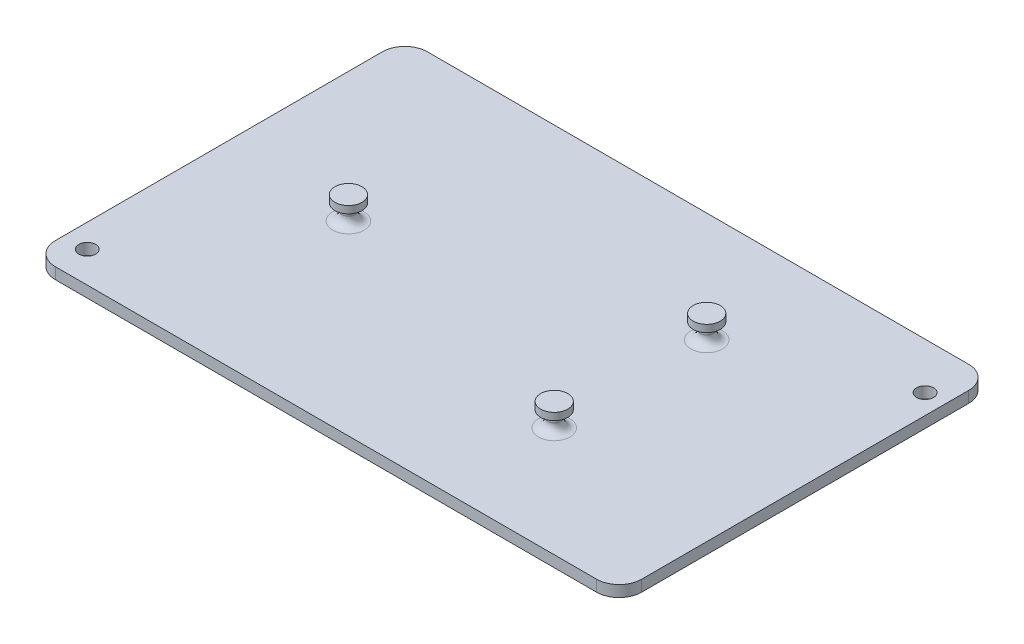
ISO-10303-21;
HEADER;
FILE_DESCRIPTION(('STEP AP214'),'2;1');
FILE_NAME('part.step','',(''),(''),'','','');
FILE_SCHEMA(('AUTOMOTIVE_DESIGN { 1 0 10303 214 1 1 1 1 }'));
ENDSEC;
DATA;
#1=APPLICATION_CONTEXT('core data for automotive mechanical design processes');
#2=APPLICATION_PROTOCOL_DEFINITION('international standard','automotive_design',2000,#1);
#3=PRODUCT_CONTEXT('',#1,'mechanical');
#4=PRODUCT('Part','Part','',(#3));
#5=PRODUCT_RELATED_PRODUCT_CATEGORY('part','',(#4));
#6=PRODUCT_DEFINITION_FORMATION('','',#4);
#7=PRODUCT_DEFINITION_CONTEXT('part definition',#1,'design');
#8=PRODUCT_DEFINITION('design','',#6,#7);
#9=PRODUCT_DEFINITION_SHAPE('','',#8);
#10=(LENGTH_UNIT() NAMED_UNIT(*) SI_UNIT(.MILLI.,.METRE.));
#11=(NAMED_UNIT(*) PLANE_ANGLE_UNIT() SI_UNIT($,.RADIAN.));
#12=(NAMED_UNIT(*) SI_UNIT($,.STERADIAN.) SOLID_ANGLE_UNIT());
#13=UNCERTAINTY_MEASURE_WITH_UNIT(LENGTH_MEASURE(1.E-05),#10,'distance_accuracy_value','');
#14=(GEOMETRIC_REPRESENTATION_CONTEXT(3) GLOBAL_UNCERTAINTY_ASSIGNED_CONTEXT((#13)) GLOBAL_UNIT_ASSIGNED_CONTEXT((#10,
#11,#12)) REPRESENTATION_CONTEXT('',''));
#15=CARTESIAN_POINT('',(0.,0.,0.));
#16=DIRECTION('',(0.,0.,1.));
#17=DIRECTION('',(1.,0.,0.));
#18=AXIS2_PLACEMENT_3D('',#15,#16,#17);
#19=CARTESIAN_POINT('',(82.55,3.175,52.3875));
#20=DIRECTION('',(-1.,0.,0.));
#21=DIRECTION('',(0.,0.,1.));
#22=AXIS2_PLACEMENT_3D('',#19,#20,#21);
#23=PLANE('',#22);
#24=DIRECTION('',(0.,0.,-1.));
#25=VECTOR('',#24,1.);
#26=CARTESIAN_POINT('',(82.55,0.,52.3875));
#27=LINE('',#26,#25);
#28=CARTESIAN_POINT('',(82.55,0.,46.0375));
#29=VERTEX_POINT('',#28);
#30=CARTESIAN_POINT('',(82.55,0.,-46.0375));
#31=VERTEX_POINT('',#30);
#32=EDGE_CURVE('E141',#29,#31,#27,.T.);
#33=ORIENTED_EDGE('',*,*,#32,.T.);
#34=DIRECTION('',(0.,-1.,0.));
#35=VECTOR('',#34,1.);
#36=CARTESIAN_POINT('',(82.55,3.175,-46.0375));
#37=LINE('',#36,#35);
#38=CARTESIAN_POINT('',(82.55,3.175,-46.0375));
#39=VERTEX_POINT('',#38);
#40=EDGE_CURVE('E11',#31,#39,#37,.F.);
#41=ORIENTED_EDGE('',*,*,#40,.T.);
#42=DIRECTION('',(0.,0.,-1.));
#43=VECTOR('',#42,1.);
#44=CARTESIAN_POINT('',(82.55,3.175,52.3875));
#45=LINE('',#44,#43);
#46=CARTESIAN_POINT('',(82.55,3.175,46.0375));
#47=VERTEX_POINT('',#46);
#48=EDGE_CURVE('E139',#47,#39,#45,.T.);
#49=ORIENTED_EDGE('',*,*,#48,.F.);
#50=DIRECTION('',(0.,-1.,0.));
#51=VECTOR('',#50,1.);
#52=CARTESIAN_POINT('',(82.55,3.175,46.0375));
#53=LINE('',#52,#51);
#54=EDGE_CURVE('E48',#47,#29,#53,.T.);
#55=ORIENTED_EDGE('',*,*,#54,.T.);
#56=EDGE_LOOP('',(#33,#41,#49,#55));
#57=FACE_BOUND('',#56,.T.);
#58=ADVANCED_FACE('F39',(#57),#23,.F.);
#59=CARTESIAN_POINT('',(-82.55,3.175,-52.3875));
#60=DIRECTION('',(0.,0.,1.));
#61=DIRECTION('',(1.,0.,0.));
#62=AXIS2_PLACEMENT_3D('',#59,#60,#61);
#63=PLANE('',#62);
#64=DIRECTION('',(-1.,0.,0.));
#65=VECTOR('',#64,1.);
#66=CARTESIAN_POINT('',(-82.55,0.,-52.3875));
#67=LINE('',#66,#65);
#68=CARTESIAN_POINT('',(76.2,0.,-52.3875));
#69=VERTEX_POINT('',#68);
#70=CARTESIAN_POINT('',(-76.2,0.,-52.3875));
#71=VERTEX_POINT('',#70);
#72=EDGE_CURVE('E135',#69,#71,#67,.T.);
#73=ORIENTED_EDGE('',*,*,#72,.T.);
#74=DIRECTION('',(0.,-1.,0.));
#75=VECTOR('',#74,1.);
#76=CARTESIAN_POINT('',(-76.2,3.175,-52.3875));
#77=LINE('',#76,#75);
#78=CARTESIAN_POINT('',(-76.2,3.175,-52.3875));
#79=VERTEX_POINT('',#78);
#80=EDGE_CURVE('E111',#71,#79,#77,.F.);
#81=ORIENTED_EDGE('',*,*,#80,.T.);
#82=DIRECTION('',(-1.,0.,0.));
#83=VECTOR('',#82,1.);
#84=CARTESIAN_POINT('',(-82.55,3.175,-52.3875));
#85=LINE('',#84,#83);
#86=CARTESIAN_POINT('',(76.2,3.175,-52.3875));
#87=VERTEX_POINT('',#86);
#88=EDGE_CURVE('E246',#87,#79,#85,.T.);
#89=ORIENTED_EDGE('',*,*,#88,.F.);
#90=DIRECTION('',(0.,-1.,0.));
#91=VECTOR('',#90,1.);
#92=CARTESIAN_POINT('',(76.2,3.175,-52.3875));
#93=LINE('',#92,#91);
#94=EDGE_CURVE('E117',#87,#69,#93,.T.);
#95=ORIENTED_EDGE('',*,*,#94,.T.);
#96=EDGE_LOOP('',(#73,#81,#89,#95));
#97=FACE_BOUND('',#96,.T.);
#98=ADVANCED_FACE('F313',(#97),#63,.F.);
#99=CARTESIAN_POINT('',(-82.55,3.175,52.3875));
#100=DIRECTION('',(1.,0.,0.));
#101=DIRECTION('',(0.,0.,-1.));
#102=AXIS2_PLACEMENT_3D('',#99,#100,#101);
#103=PLANE('',#102);
#104=DIRECTION('',(0.,0.,1.));
#105=VECTOR('',#104,1.);
#106=CARTESIAN_POINT('',(-82.55,3.175,52.3875));
#107=LINE('',#106,#105);
#108=CARTESIAN_POINT('',(-82.55,3.175,-46.0375));
#109=VERTEX_POINT('',#108);
#110=CARTESIAN_POINT('',(-82.55,3.175,46.0375));
#111=VERTEX_POINT('',#110);
#112=EDGE_CURVE('E126',#109,#111,#107,.T.);
#113=ORIENTED_EDGE('',*,*,#112,.F.);
#114=DIRECTION('',(0.,-1.,0.));
#115=VECTOR('',#114,1.);
#116=CARTESIAN_POINT('',(-82.55,3.175,-46.0375));
#117=LINE('',#116,#115);
#118=CARTESIAN_POINT('',(-82.55,0.,-46.0375));
#119=VERTEX_POINT('',#118);
#120=EDGE_CURVE('E110',#109,#119,#117,.T.);
#121=ORIENTED_EDGE('',*,*,#120,.T.);
#122=DIRECTION('',(0.,0.,1.));
#123=VECTOR('',#122,1.);
#124=CARTESIAN_POINT('',(-82.55,0.,52.3875));
#125=LINE('',#124,#123);
#126=CARTESIAN_POINT('',(-82.55,0.,46.0375));
#127=VERTEX_POINT('',#126);
#128=EDGE_CURVE('E124',#119,#127,#125,.T.);
#129=ORIENTED_EDGE('',*,*,#128,.T.);
#130=DIRECTION('',(0.,-1.,0.));
#131=VECTOR('',#130,1.);
#132=CARTESIAN_POINT('',(-82.55,3.175,46.0375));
#133=LINE('',#132,#131);
#134=EDGE_CURVE('E129',#127,#111,#133,.F.);
#135=ORIENTED_EDGE('',*,*,#134,.T.);
#136=EDGE_LOOP('',(#113,#121,#129,#135));
#137=FACE_BOUND('',#136,.T.);
#138=ADVANCED_FACE('F123',(#137),#103,.F.);
#139=CARTESIAN_POINT('',(-82.55,3.175,52.3875));
#140=DIRECTION('',(0.,0.,-1.));
#141=DIRECTION('',(-1.,0.,0.));
#142=AXIS2_PLACEMENT_3D('',#139,#140,#141);
#143=PLANE('',#142);
#144=DIRECTION('',(1.,0.,0.));
#145=VECTOR('',#144,1.);
#146=CARTESIAN_POINT('',(-82.55,3.175,52.3875));
#147=LINE('',#146,#145);
#148=CARTESIAN_POINT('',(-76.2,3.175,52.3875));
#149=VERTEX_POINT('',#148);
#150=CARTESIAN_POINT('',(76.2,3.175,52.3875));
#151=VERTEX_POINT('',#150);
#152=EDGE_CURVE('E150',#149,#151,#147,.T.);
#153=ORIENTED_EDGE('',*,*,#152,.F.);
#154=DIRECTION('',(0.,-1.,0.));
#155=VECTOR('',#154,1.);
#156=CARTESIAN_POINT('',(-76.2,3.175,52.3875));
#157=LINE('',#156,#155);
#158=CARTESIAN_POINT('',(-76.2,0.,52.3875));
#159=VERTEX_POINT('',#158);
#160=EDGE_CURVE('E221',#149,#159,#157,.T.);
#161=ORIENTED_EDGE('',*,*,#160,.T.);
#162=DIRECTION('',(1.,0.,0.));
#163=VECTOR('',#162,1.);
#164=CARTESIAN_POINT('',(-82.55,0.,52.3875));
#165=LINE('',#164,#163);
#166=CARTESIAN_POINT('',(76.2,0.,52.3875));
#167=VERTEX_POINT('',#166);
#168=EDGE_CURVE('E134',#159,#167,#165,.T.);
#169=ORIENTED_EDGE('',*,*,#168,.T.);
#170=DIRECTION('',(0.,-1.,0.));
#171=VECTOR('',#170,1.);
#172=CARTESIAN_POINT('',(76.2,3.175,52.3875));
#173=LINE('',#172,#171);
#174=EDGE_CURVE('E55',#167,#151,#173,.F.);
#175=ORIENTED_EDGE('',*,*,#174,.T.);
#176=EDGE_LOOP('',(#153,#161,#169,#175));
#177=FACE_BOUND('',#176,.T.);
#178=ADVANCED_FACE('F300',(#177),#143,.F.);
#179=CARTESIAN_POINT('',(0.,3.175,0.));
#180=DIRECTION('',(0.,-1.,0.));
#181=DIRECTION('',(0.,0.,-1.));
#182=AXIS2_PLACEMENT_3D('',#179,#180,#181);
#183=PLANE('',#182);
#184=CARTESIAN_POINT('',(-75.9329952,3.175,43.643499962));
#185=DIRECTION('',(0.,1.,0.));
#186=DIRECTION('',(0.,0.,1.));
#187=AXIS2_PLACEMENT_3D('',#184,#185,#186);
#188=CIRCLE('',#187,2.38125);
#189=CARTESIAN_POINT('',(-75.9329952,3.175,46.024749962));
#190=VERTEX_POINT('',#189);
#191=EDGE_CURVE('E280',#190,#190,#188,.T.);
#192=ORIENTED_EDGE('',*,*,#191,.F.);
#193=EDGE_LOOP('',(#192));
#194=FACE_BOUND('',#193,.T.);
#195=CARTESIAN_POINT('',(76.96699999,3.175,-39.3344908));
#196=DIRECTION('',(0.,1.,0.));
#197=DIRECTION('',(0.,0.,1.));
#198=AXIS2_PLACEMENT_3D('',#195,#196,#197);
#199=CIRCLE('',#198,2.38125);
#200=CARTESIAN_POINT('',(76.96699999,3.175,-36.9532408));
#201=VERTEX_POINT('',#200);
#202=EDGE_CURVE('E272',#201,#201,#199,.T.);
#203=ORIENTED_EDGE('',*,*,#202,.F.);
#204=EDGE_LOOP('',(#203));
#205=FACE_BOUND('',#204,.T.);
#206=CARTESIAN_POINT('',(33.3502,3.175,-21.463));
#207=DIRECTION('',(0.,-1.,0.));
#208=DIRECTION('',(0.,0.,-1.));
#209=AXIS2_PLACEMENT_3D('',#206,#207,#208);
#210=CIRCLE('',#209,4.445);
#211=CARTESIAN_POINT('',(33.3502,3.175,-25.908));
#212=VERTEX_POINT('',#211);
#213=EDGE_CURVE('E158',#212,#212,#210,.T.);
#214=ORIENTED_EDGE('',*,*,#213,.T.);
#215=EDGE_LOOP('',(#214));
#216=FACE_BOUND('',#215,.T.);
#217=CARTESIAN_POINT('',(33.3502,3.175,21.463));
#218=DIRECTION('',(0.,-1.,0.));
#219=DIRECTION('',(0.,0.,-1.));
#220=AXIS2_PLACEMENT_3D('',#217,#218,#219);
#221=CIRCLE('',#220,4.445);
#222=CARTESIAN_POINT('',(33.3502,3.175,17.018));
#223=VERTEX_POINT('',#222);
#224=EDGE_CURVE('E154',#223,#223,#221,.T.);
#225=ORIENTED_EDGE('',*,*,#224,.T.);
#226=EDGE_LOOP('',(#225));
#227=FACE_BOUND('',#226,.T.);
#228=CARTESIAN_POINT('',(-46.0502,3.175,0.));
#229=DIRECTION('',(0.,-1.,0.));
#230=DIRECTION('',(0.,0.,-1.));
#231=AXIS2_PLACEMENT_3D('',#228,#229,#230);
#232=CIRCLE('',#231,4.445);
#233=CARTESIAN_POINT('',(-46.0502,3.175,-4.445));
#234=VERTEX_POINT('',#233);
#235=EDGE_CURVE('E149',#234,#234,#232,.T.);
#236=ORIENTED_EDGE('',*,*,#235,.T.);
#237=EDGE_LOOP('',(#236));
#238=FACE_BOUND('',#237,.T.);
#239=ORIENTED_EDGE('',*,*,#88,.T.);
#240=CARTESIAN_POINT('',(-76.2,3.175,-46.0375));
#241=DIRECTION('',(0.,-1.,0.));
#242=DIRECTION('',(0.,0.,-1.));
#243=AXIS2_PLACEMENT_3D('',#240,#241,#242);
#244=CIRCLE('',#243,6.35);
#245=EDGE_CURVE('E216',#79,#109,#244,.F.);
#246=ORIENTED_EDGE('',*,*,#245,.T.);
#247=ORIENTED_EDGE('',*,*,#112,.T.);
#248=CARTESIAN_POINT('',(-76.2,3.175,46.0375));
#249=DIRECTION('',(0.,-1.,0.));
#250=DIRECTION('',(0.,0.,-1.));
#251=AXIS2_PLACEMENT_3D('',#248,#249,#250);
#252=CIRCLE('',#251,6.35);
#253=EDGE_CURVE('E62',#111,#149,#252,.F.);
#254=ORIENTED_EDGE('',*,*,#253,.T.);
#255=ORIENTED_EDGE('',*,*,#152,.T.);
#256=CARTESIAN_POINT('',(76.2,3.175,46.0375));
#257=DIRECTION('',(0.,-1.,0.));
#258=DIRECTION('',(0.,0.,-1.));
#259=AXIS2_PLACEMENT_3D('',#256,#257,#258);
#260=CIRCLE('',#259,6.35);
#261=EDGE_CURVE('E208',#151,#47,#260,.F.);
#262=ORIENTED_EDGE('',*,*,#261,.T.);
#263=ORIENTED_EDGE('',*,*,#48,.T.);
#264=CARTESIAN_POINT('',(76.2,3.175,-46.0375));
#265=DIRECTION('',(0.,-1.,0.));
#266=DIRECTION('',(0.,0.,-1.));
#267=AXIS2_PLACEMENT_3D('',#264,#265,#266);
#268=CIRCLE('',#267,6.35);
#269=EDGE_CURVE('E211',#39,#87,#268,.F.);
#270=ORIENTED_EDGE('',*,*,#269,.T.);
#271=EDGE_LOOP('',(#239,#246,#247,#254,#255,#262,#263,#270));
#272=FACE_BOUND('',#271,.T.);
#273=ADVANCED_FACE('F297',(#194,#205,#216,#227,#238,#272),#183,.F.);
#274=CARTESIAN_POINT('',(0.,0.,0.));
#275=DIRECTION('',(0.,-1.,0.));
#276=DIRECTION('',(0.,0.,-1.));
#277=AXIS2_PLACEMENT_3D('',#274,#275,#276);
#278=PLANE('',#277);
#279=CARTESIAN_POINT('',(-75.9329952,0.,43.643499962));
#280=DIRECTION('',(0.,1.,0.));
#281=DIRECTION('',(0.,0.,1.));
#282=AXIS2_PLACEMENT_3D('',#279,#280,#281);
#283=CIRCLE('',#282,2.38125);
#284=CARTESIAN_POINT('',(-75.9329952,0.,46.024749962));
#285=VERTEX_POINT('',#284);
#286=EDGE_CURVE('E271',#285,#285,#283,.T.);
#287=ORIENTED_EDGE('',*,*,#286,.T.);
#288=EDGE_LOOP('',(#287));
#289=FACE_BOUND('',#288,.T.);
#290=CARTESIAN_POINT('',(76.96699999,0.,-39.3344908));
#291=DIRECTION('',(0.,1.,0.));
#292=DIRECTION('',(0.,0.,1.));
#293=AXIS2_PLACEMENT_3D('',#290,#291,#292);
#294=CIRCLE('',#293,2.38125);
#295=CARTESIAN_POINT('',(76.96699999,0.,-36.9532408));
#296=VERTEX_POINT('',#295);
#297=EDGE_CURVE('E276',#296,#296,#294,.T.);
#298=ORIENTED_EDGE('',*,*,#297,.T.);
#299=EDGE_LOOP('',(#298));
#300=FACE_BOUND('',#299,.T.);
#301=ORIENTED_EDGE('',*,*,#128,.F.);
#302=CARTESIAN_POINT('',(-76.2,0.,-46.0375));
#303=DIRECTION('',(0.,-1.,0.));
#304=DIRECTION('',(0.,0.,-1.));
#305=AXIS2_PLACEMENT_3D('',#302,#303,#304);
#306=CIRCLE('',#305,6.35);
#307=EDGE_CURVE('E106',#119,#71,#306,.T.);
#308=ORIENTED_EDGE('',*,*,#307,.T.);
#309=ORIENTED_EDGE('',*,*,#72,.F.);
#310=CARTESIAN_POINT('',(76.2,0.,-46.0375));
#311=DIRECTION('',(0.,-1.,0.));
#312=DIRECTION('',(0.,0.,-1.));
#313=AXIS2_PLACEMENT_3D('',#310,#311,#312);
#314=CIRCLE('',#313,6.35);
#315=EDGE_CURVE('E198',#69,#31,#314,.T.);
#316=ORIENTED_EDGE('',*,*,#315,.T.);
#317=ORIENTED_EDGE('',*,*,#32,.F.);
#318=CARTESIAN_POINT('',(76.2,0.,46.0375));
#319=DIRECTION('',(0.,-1.,0.));
#320=DIRECTION('',(0.,0.,-1.));
#321=AXIS2_PLACEMENT_3D('',#318,#319,#320);
#322=CIRCLE('',#321,6.35);
#323=EDGE_CURVE('E128',#29,#167,#322,.T.);
#324=ORIENTED_EDGE('',*,*,#323,.T.);
#325=ORIENTED_EDGE('',*,*,#168,.F.);
#326=CARTESIAN_POINT('',(-76.2,0.,46.0375));
#327=DIRECTION('',(0.,-1.,0.));
#328=DIRECTION('',(0.,0.,-1.));
#329=AXIS2_PLACEMENT_3D('',#326,#327,#328);
#330=CIRCLE('',#329,6.35);
#331=EDGE_CURVE('E118',#159,#127,#330,.T.);
#332=ORIENTED_EDGE('',*,*,#331,.T.);
#333=EDGE_LOOP('',(#301,#308,#309,#316,#317,#324,#325,#332));
#334=FACE_BOUND('',#333,.T.);
#335=ADVANCED_FACE('F131',(#289,#300,#334),#278,.T.);
#336=CARTESIAN_POINT('',(-46.0502,9.652,0.));
#337=DIRECTION('',(0.,1.,0.));
#338=DIRECTION('',(0.,0.,1.));
#339=AXIS2_PLACEMENT_3D('',#336,#337,#338);
#340=PLANE('',#339);
#341=CARTESIAN_POINT('',(-46.0502,9.652,0.));
#342=DIRECTION('',(0.,-1.,0.));
#343=DIRECTION('',(0.,0.,-1.));
#344=AXIS2_PLACEMENT_3D('',#341,#342,#343);
#345=CIRCLE('',#344,3.81);
#346=CARTESIAN_POINT('',(-46.0502,9.652,-3.81));
#347=VERTEX_POINT('',#346);
#348=EDGE_CURVE('E236',#347,#347,#345,.T.);
#349=ORIENTED_EDGE('',*,*,#348,.F.);
#350=EDGE_LOOP('',(#349));
#351=FACE_BOUND('',#350,.T.);
#352=ADVANCED_FACE('F371',(#351),#340,.T.);
#353=CARTESIAN_POINT('',(-46.0502,3.175,0.));
#354=DIRECTION('',(0.,-1.,0.));
#355=DIRECTION('',(0.,0.,-1.));
#356=AXIS2_PLACEMENT_3D('',#353,#354,#355);
#357=CYLINDRICAL_SURFACE('',#356,3.81);
#358=ORIENTED_EDGE('',*,*,#348,.T.);
#359=EDGE_LOOP('',(#358));
#360=FACE_BOUND('',#359,.T.);
#361=CARTESIAN_POINT('',(-46.0502,7.62,0.));
#362=DIRECTION('',(0.,-1.,0.));
#363=DIRECTION('',(0.,0.,-1.));
#364=AXIS2_PLACEMENT_3D('',#361,#362,#363);
#365=CIRCLE('',#364,3.81);
#366=CARTESIAN_POINT('',(-46.0502,7.62,-3.81));
#367=VERTEX_POINT('',#366);
#368=EDGE_CURVE('E239',#367,#367,#365,.T.);
#369=ORIENTED_EDGE('',*,*,#368,.F.);
#370=EDGE_LOOP('',(#369));
#371=FACE_BOUND('',#370,.T.);
#372=ADVANCED_FACE('F375',(#360,#371),#357,.T.);
#373=CARTESIAN_POINT('',(-42.2402,7.62,0.));
#374=DIRECTION('',(0.,-1.,0.));
#375=DIRECTION('',(0.,0.,-1.));
#376=AXIS2_PLACEMENT_3D('',#373,#374,#375);
#377=PLANE('',#376);
#378=CARTESIAN_POINT('',(-46.0502,7.62,0.));
#379=DIRECTION('',(0.,-1.,0.));
#380=DIRECTION('',(0.,0.,-1.));
#381=AXIS2_PLACEMENT_3D('',#378,#379,#380);
#382=CIRCLE('',#381,2.413);
#383=CARTESIAN_POINT('',(-46.0502,7.62,-2.413));
#384=VERTEX_POINT('',#383);
#385=EDGE_CURVE('E190',#384,#384,#382,.F.);
#386=ORIENTED_EDGE('',*,*,#385,.T.);
#387=EDGE_LOOP('',(#386));
#388=FACE_BOUND('',#387,.T.);
#389=ORIENTED_EDGE('',*,*,#368,.T.);
#390=EDGE_LOOP('',(#389));
#391=FACE_BOUND('',#390,.T.);
#392=ADVANCED_FACE('F379',(#388,#391),#377,.T.);
#393=CARTESIAN_POINT('',(-46.0502,3.175,0.));
#394=DIRECTION('',(0.,-1.,0.));
#395=DIRECTION('',(0.,0.,-1.));
#396=AXIS2_PLACEMENT_3D('',#393,#394,#395);
#397=CYLINDRICAL_SURFACE('',#396,1.905);
#398=CARTESIAN_POINT('',(-46.0502,7.112,0.));
#399=DIRECTION('',(0.,-1.,0.));
#400=DIRECTION('',(0.,0.,-1.));
#401=AXIS2_PLACEMENT_3D('',#398,#399,#400);
#402=CIRCLE('',#401,1.905);
#403=CARTESIAN_POINT('',(-46.0502,7.112,-1.905));
#404=VERTEX_POINT('',#403);
#405=EDGE_CURVE('E186',#404,#404,#402,.T.);
#406=ORIENTED_EDGE('',*,*,#405,.T.);
#407=EDGE_LOOP('',(#406));
#408=FACE_BOUND('',#407,.T.);
#409=CARTESIAN_POINT('',(-46.0502,5.715,0.));
#410=DIRECTION('',(0.,-1.,0.));
#411=DIRECTION('',(0.,0.,-1.));
#412=AXIS2_PLACEMENT_3D('',#409,#410,#411);
#413=CIRCLE('',#412,1.905);
#414=CARTESIAN_POINT('',(-46.0502,5.715,-1.905));
#415=VERTEX_POINT('',#414);
#416=EDGE_CURVE('E166',#415,#415,#413,.F.);
#417=ORIENTED_EDGE('',*,*,#416,.T.);
#418=EDGE_LOOP('',(#417));
#419=FACE_BOUND('',#418,.T.);
#420=ADVANCED_FACE('F383',(#408,#419),#397,.T.);
#421=CARTESIAN_POINT('',(33.3502,9.652,21.463));
#422=DIRECTION('',(0.,1.,0.));
#423=DIRECTION('',(0.,0.,1.));
#424=AXIS2_PLACEMENT_3D('',#421,#422,#423);
#425=PLANE('',#424);
#426=CARTESIAN_POINT('',(33.3502,9.652,21.463));
#427=DIRECTION('',(0.,-1.,0.));
#428=DIRECTION('',(0.,0.,-1.));
#429=AXIS2_PLACEMENT_3D('',#426,#427,#428);
#430=CIRCLE('',#429,3.81);
#431=CARTESIAN_POINT('',(33.3502,9.652,17.653));
#432=VERTEX_POINT('',#431);
#433=EDGE_CURVE('E255',#432,#432,#430,.T.);
#434=ORIENTED_EDGE('',*,*,#433,.F.);
#435=EDGE_LOOP('',(#434));
#436=FACE_BOUND('',#435,.T.);
#437=ADVANCED_FACE('F387',(#436),#425,.T.);
#438=CARTESIAN_POINT('',(33.3502,3.175,21.463));
#439=DIRECTION('',(0.,-1.,0.));
#440=DIRECTION('',(0.,0.,-1.));
#441=AXIS2_PLACEMENT_3D('',#438,#439,#440);
#442=CYLINDRICAL_SURFACE('',#441,3.81);
#443=ORIENTED_EDGE('',*,*,#433,.T.);
#444=EDGE_LOOP('',(#443));
#445=FACE_BOUND('',#444,.T.);
#446=CARTESIAN_POINT('',(33.3502,7.62,21.463));
#447=DIRECTION('',(0.,-1.,0.));
#448=DIRECTION('',(0.,0.,-1.));
#449=AXIS2_PLACEMENT_3D('',#446,#447,#448);
#450=CIRCLE('',#449,3.81);
#451=CARTESIAN_POINT('',(33.3502,7.62,17.653));
#452=VERTEX_POINT('',#451);
#453=EDGE_CURVE('E259',#452,#452,#450,.T.);
#454=ORIENTED_EDGE('',*,*,#453,.F.);
#455=EDGE_LOOP('',(#454));
#456=FACE_BOUND('',#455,.T.);
#457=ADVANCED_FACE('F391',(#445,#456),#442,.T.);
#458=CARTESIAN_POINT('',(33.3502,7.62,17.653));
#459=DIRECTION('',(0.,-1.,0.));
#460=DIRECTION('',(0.,0.,-1.));
#461=AXIS2_PLACEMENT_3D('',#458,#459,#460);
#462=PLANE('',#461);
#463=CARTESIAN_POINT('',(33.3502,7.62,21.463));
#464=DIRECTION('',(0.,-1.,0.));
#465=DIRECTION('',(0.,0.,-1.));
#466=AXIS2_PLACEMENT_3D('',#463,#464,#465);
#467=CIRCLE('',#466,2.413);
#468=CARTESIAN_POINT('',(33.3502,7.62,19.05));
#469=VERTEX_POINT('',#468);
#470=EDGE_CURVE('E182',#469,#469,#467,.F.);
#471=ORIENTED_EDGE('',*,*,#470,.T.);
#472=EDGE_LOOP('',(#471));
#473=FACE_BOUND('',#472,.T.);
#474=ORIENTED_EDGE('',*,*,#453,.T.);
#475=EDGE_LOOP('',(#474));
#476=FACE_BOUND('',#475,.T.);
#477=ADVANCED_FACE('F395',(#473,#476),#462,.T.);
#478=CARTESIAN_POINT('',(33.3502,3.175,21.463));
#479=DIRECTION('',(0.,-1.,0.));
#480=DIRECTION('',(0.,0.,-1.));
#481=AXIS2_PLACEMENT_3D('',#478,#479,#480);
#482=CYLINDRICAL_SURFACE('',#481,1.905);
#483=CARTESIAN_POINT('',(33.3502,7.112,21.463));
#484=DIRECTION('',(0.,-1.,0.));
#485=DIRECTION('',(0.,0.,-1.));
#486=AXIS2_PLACEMENT_3D('',#483,#484,#485);
#487=CIRCLE('',#486,1.905);
#488=CARTESIAN_POINT('',(33.3502,7.112,19.558));
#489=VERTEX_POINT('',#488);
#490=EDGE_CURVE('E178',#489,#489,#487,.T.);
#491=ORIENTED_EDGE('',*,*,#490,.T.);
#492=EDGE_LOOP('',(#491));
#493=FACE_BOUND('',#492,.T.);
#494=CARTESIAN_POINT('',(33.3502,5.715,21.463));
#495=DIRECTION('',(0.,-1.,0.));
#496=DIRECTION('',(0.,0.,-1.));
#497=AXIS2_PLACEMENT_3D('',#494,#495,#496);
#498=CIRCLE('',#497,1.905);
#499=CARTESIAN_POINT('',(33.3502,5.715,19.558));
#500=VERTEX_POINT('',#499);
#501=EDGE_CURVE('E162',#500,#500,#498,.F.);
#502=ORIENTED_EDGE('',*,*,#501,.T.);
#503=EDGE_LOOP('',(#502));
#504=FACE_BOUND('',#503,.T.);
#505=ADVANCED_FACE('F399',(#493,#504),#482,.T.);
#506=CARTESIAN_POINT('',(33.3502,9.652,-21.463));
#507=DIRECTION('',(0.,1.,0.));
#508=DIRECTION('',(0.,0.,-1.));
#509=AXIS2_PLACEMENT_3D('',#506,#507,#508);
#510=PLANE('',#509);
#511=CARTESIAN_POINT('',(33.3502,9.652,-21.463));
#512=DIRECTION('',(0.,1.,0.));
#513=DIRECTION('',(0.,0.,1.));
#514=AXIS2_PLACEMENT_3D('',#511,#512,#513);
#515=CIRCLE('',#514,3.81);
#516=CARTESIAN_POINT('',(33.3502,9.652,-17.653));
#517=VERTEX_POINT('',#516);
#518=EDGE_CURVE('E263',#517,#517,#515,.T.);
#519=ORIENTED_EDGE('',*,*,#518,.T.);
#520=EDGE_LOOP('',(#519));
#521=FACE_BOUND('',#520,.T.);
#522=ADVANCED_FACE('F403',(#521),#510,.T.);
#523=CARTESIAN_POINT('',(33.3502,3.175,-21.463));
#524=DIRECTION('',(0.,-1.,0.));
#525=DIRECTION('',(0.,0.,1.));
#526=AXIS2_PLACEMENT_3D('',#523,#524,#525);
#527=CYLINDRICAL_SURFACE('',#526,3.81);
#528=ORIENTED_EDGE('',*,*,#518,.F.);
#529=EDGE_LOOP('',(#528));
#530=FACE_BOUND('',#529,.T.);
#531=CARTESIAN_POINT('',(33.3502,7.62,-21.463));
#532=DIRECTION('',(0.,1.,0.));
#533=DIRECTION('',(0.,0.,1.));
#534=AXIS2_PLACEMENT_3D('',#531,#532,#533);
#535=CIRCLE('',#534,3.81);
#536=CARTESIAN_POINT('',(33.3502,7.62,-17.653));
#537=VERTEX_POINT('',#536);
#538=EDGE_CURVE('E267',#537,#537,#535,.T.);
#539=ORIENTED_EDGE('',*,*,#538,.T.);
#540=EDGE_LOOP('',(#539));
#541=FACE_BOUND('',#540,.T.);
#542=ADVANCED_FACE('F407',(#530,#541),#527,.T.);
#543=CARTESIAN_POINT('',(33.3502,7.62,-17.653));
#544=DIRECTION('',(0.,-1.,0.));
#545=DIRECTION('',(0.,0.,1.));
#546=AXIS2_PLACEMENT_3D('',#543,#544,#545);
#547=PLANE('',#546);
#548=CARTESIAN_POINT('',(33.3502,7.62,-21.463));
#549=DIRECTION('',(0.,-1.,0.));
#550=DIRECTION('',(0.,0.,-1.));
#551=AXIS2_PLACEMENT_3D('',#548,#549,#550);
#552=CIRCLE('',#551,2.413);
#553=CARTESIAN_POINT('',(33.3502,7.62,-23.876));
#554=VERTEX_POINT('',#553);
#555=EDGE_CURVE('E170',#554,#554,#552,.F.);
#556=ORIENTED_EDGE('',*,*,#555,.T.);
#557=EDGE_LOOP('',(#556));
#558=FACE_BOUND('',#557,.T.);
#559=ORIENTED_EDGE('',*,*,#538,.F.);
#560=EDGE_LOOP('',(#559));
#561=FACE_BOUND('',#560,.T.);
#562=ADVANCED_FACE('F411',(#558,#561),#547,.T.);
#563=CARTESIAN_POINT('',(33.3502,3.175,-21.463));
#564=DIRECTION('',(0.,-1.,0.));
#565=DIRECTION('',(0.,0.,1.));
#566=AXIS2_PLACEMENT_3D('',#563,#564,#565);
#567=CYLINDRICAL_SURFACE('',#566,1.905);
#568=CARTESIAN_POINT('',(33.3502,7.112,-21.463));
#569=DIRECTION('',(0.,-1.,0.));
#570=DIRECTION('',(0.,0.,-1.));
#571=AXIS2_PLACEMENT_3D('',#568,#569,#570);
#572=CIRCLE('',#571,1.905);
#573=CARTESIAN_POINT('',(33.3502,7.112,-23.368));
#574=VERTEX_POINT('',#573);
#575=EDGE_CURVE('E174',#574,#574,#572,.T.);
#576=ORIENTED_EDGE('',*,*,#575,.T.);
#577=EDGE_LOOP('',(#576));
#578=FACE_BOUND('',#577,.T.);
#579=CARTESIAN_POINT('',(33.3502,5.715,-21.463));
#580=DIRECTION('',(0.,-1.,0.));
#581=DIRECTION('',(0.,0.,-1.));
#582=AXIS2_PLACEMENT_3D('',#579,#580,#581);
#583=CIRCLE('',#582,1.905);
#584=CARTESIAN_POINT('',(33.3502,5.715,-23.368));
#585=VERTEX_POINT('',#584);
#586=EDGE_CURVE('E145',#585,#585,#583,.F.);
#587=ORIENTED_EDGE('',*,*,#586,.T.);
#588=EDGE_LOOP('',(#587));
#589=FACE_BOUND('',#588,.T.);
#590=ADVANCED_FACE('F336',(#578,#589),#567,.T.);
#591=CARTESIAN_POINT('',(33.3502,5.715,-21.463));
#592=DIRECTION('',(0.,-1.,0.));
#593=DIRECTION('',(0.,0.,-1.));
#594=AXIS2_PLACEMENT_3D('',#591,#592,#593);
#595=TOROIDAL_SURFACE('',#594,4.445,2.54);
#596=ORIENTED_EDGE('',*,*,#213,.F.);
#597=EDGE_LOOP('',(#596));
#598=FACE_BOUND('',#597,.T.);
#599=ORIENTED_EDGE('',*,*,#586,.F.);
#600=EDGE_LOOP('',(#599));
#601=FACE_BOUND('',#600,.T.);
#602=ADVANCED_FACE('F332',(#598,#601),#595,.F.);
#603=CARTESIAN_POINT('',(33.3502,5.715,21.463));
#604=DIRECTION('',(0.,-1.,0.));
#605=DIRECTION('',(0.,0.,-1.));
#606=AXIS2_PLACEMENT_3D('',#603,#604,#605);
#607=TOROIDAL_SURFACE('',#606,4.445,2.54);
#608=ORIENTED_EDGE('',*,*,#501,.F.);
#609=EDGE_LOOP('',(#608));
#610=FACE_BOUND('',#609,.T.);
#611=ORIENTED_EDGE('',*,*,#224,.F.);
#612=EDGE_LOOP('',(#611));
#613=FACE_BOUND('',#612,.T.);
#614=ADVANCED_FACE('F335',(#610,#613),#607,.F.);
#615=CARTESIAN_POINT('',(-46.0502,5.715,0.));
#616=DIRECTION('',(0.,-1.,0.));
#617=DIRECTION('',(0.,0.,-1.));
#618=AXIS2_PLACEMENT_3D('',#615,#616,#617);
#619=TOROIDAL_SURFACE('',#618,4.445,2.54);
#620=ORIENTED_EDGE('',*,*,#416,.F.);
#621=EDGE_LOOP('',(#620));
#622=FACE_BOUND('',#621,.T.);
#623=ORIENTED_EDGE('',*,*,#235,.F.);
#624=EDGE_LOOP('',(#623));
#625=FACE_BOUND('',#624,.T.);
#626=ADVANCED_FACE('F340',(#622,#625),#619,.F.);
#627=CARTESIAN_POINT('',(33.3502,7.112,-21.463));
#628=DIRECTION('',(0.,-1.,0.));
#629=DIRECTION('',(0.,0.,-1.));
#630=AXIS2_PLACEMENT_3D('',#627,#628,#629);
#631=TOROIDAL_SURFACE('',#630,2.413,0.508);
#632=ORIENTED_EDGE('',*,*,#575,.F.);
#633=EDGE_LOOP('',(#632));
#634=FACE_BOUND('',#633,.T.);
#635=ORIENTED_EDGE('',*,*,#555,.F.);
#636=EDGE_LOOP('',(#635));
#637=FACE_BOUND('',#636,.T.);
#638=ADVANCED_FACE('F344',(#634,#637),#631,.F.);
#639=CARTESIAN_POINT('',(33.3502,7.112,21.463));
#640=DIRECTION('',(0.,-1.,0.));
#641=DIRECTION('',(0.,0.,-1.));
#642=AXIS2_PLACEMENT_3D('',#639,#640,#641);
#643=TOROIDAL_SURFACE('',#642,2.413,0.508);
#644=ORIENTED_EDGE('',*,*,#470,.F.);
#645=EDGE_LOOP('',(#644));
#646=FACE_BOUND('',#645,.T.);
#647=ORIENTED_EDGE('',*,*,#490,.F.);
#648=EDGE_LOOP('',(#647));
#649=FACE_BOUND('',#648,.T.);
#650=ADVANCED_FACE('F348',(#646,#649),#643,.F.);
#651=CARTESIAN_POINT('',(-46.0502,7.112,0.));
#652=DIRECTION('',(0.,-1.,0.));
#653=DIRECTION('',(0.,0.,-1.));
#654=AXIS2_PLACEMENT_3D('',#651,#652,#653);
#655=TOROIDAL_SURFACE('',#654,2.413,0.508);
#656=ORIENTED_EDGE('',*,*,#385,.F.);
#657=EDGE_LOOP('',(#656));
#658=FACE_BOUND('',#657,.T.);
#659=ORIENTED_EDGE('',*,*,#405,.F.);
#660=EDGE_LOOP('',(#659));
#661=FACE_BOUND('',#660,.T.);
#662=ADVANCED_FACE('F352',(#658,#661),#655,.F.);
#663=CARTESIAN_POINT('',(-76.2,3.175,-46.0375));
#664=DIRECTION('',(0.,-1.,0.));
#665=DIRECTION('',(0.,0.,-1.));
#666=AXIS2_PLACEMENT_3D('',#663,#664,#665);
#667=CYLINDRICAL_SURFACE('',#666,6.35);
#668=ORIENTED_EDGE('',*,*,#245,.F.);
#669=ORIENTED_EDGE('',*,*,#80,.F.);
#670=ORIENTED_EDGE('',*,*,#307,.F.);
#671=ORIENTED_EDGE('',*,*,#120,.F.);
#672=EDGE_LOOP('',(#668,#669,#670,#671));
#673=FACE_BOUND('',#672,.T.);
#674=ADVANCED_FACE('F109',(#673),#667,.T.);
#675=CARTESIAN_POINT('',(-76.2,3.175,46.0375));
#676=DIRECTION('',(0.,-1.,0.));
#677=DIRECTION('',(0.,0.,-1.));
#678=AXIS2_PLACEMENT_3D('',#675,#676,#677);
#679=CYLINDRICAL_SURFACE('',#678,6.35);
#680=ORIENTED_EDGE('',*,*,#253,.F.);
#681=ORIENTED_EDGE('',*,*,#134,.F.);
#682=ORIENTED_EDGE('',*,*,#331,.F.);
#683=ORIENTED_EDGE('',*,*,#160,.F.);
#684=EDGE_LOOP('',(#680,#681,#682,#683));
#685=FACE_BOUND('',#684,.T.);
#686=ADVANCED_FACE('F323',(#685),#679,.T.);
#687=CARTESIAN_POINT('',(76.2,3.175,-46.0375));
#688=DIRECTION('',(0.,-1.,0.));
#689=DIRECTION('',(0.,0.,-1.));
#690=AXIS2_PLACEMENT_3D('',#687,#688,#689);
#691=CYLINDRICAL_SURFACE('',#690,6.35);
#692=ORIENTED_EDGE('',*,*,#269,.F.);
#693=ORIENTED_EDGE('',*,*,#40,.F.);
#694=ORIENTED_EDGE('',*,*,#315,.F.);
#695=ORIENTED_EDGE('',*,*,#94,.F.);
#696=EDGE_LOOP('',(#692,#693,#694,#695));
#697=FACE_BOUND('',#696,.T.);
#698=ADVANCED_FACE('F315',(#697),#691,.T.);
#699=CARTESIAN_POINT('',(76.2,3.175,46.0375));
#700=DIRECTION('',(0.,-1.,0.));
#701=DIRECTION('',(0.,0.,-1.));
#702=AXIS2_PLACEMENT_3D('',#699,#700,#701);
#703=CYLINDRICAL_SURFACE('',#702,6.35);
#704=ORIENTED_EDGE('',*,*,#261,.F.);
#705=ORIENTED_EDGE('',*,*,#174,.F.);
#706=ORIENTED_EDGE('',*,*,#323,.F.);
#707=ORIENTED_EDGE('',*,*,#54,.F.);
#708=EDGE_LOOP('',(#704,#705,#706,#707));
#709=FACE_BOUND('',#708,.T.);
#710=ADVANCED_FACE('F41',(#709),#703,.T.);
#711=CARTESIAN_POINT('',(76.96699999,0.,-39.3344908));
#712=DIRECTION('',(0.,1.,0.));
#713=DIRECTION('',(0.,0.,1.));
#714=AXIS2_PLACEMENT_3D('',#711,#712,#713);
#715=CYLINDRICAL_SURFACE('',#714,2.38125);
#716=ORIENTED_EDGE('',*,*,#297,.F.);
#717=EDGE_LOOP('',(#716));
#718=FACE_BOUND('',#717,.T.);
#719=ORIENTED_EDGE('',*,*,#202,.T.);
#720=EDGE_LOOP('',(#719));
#721=FACE_BOUND('',#720,.T.);
#722=ADVANCED_FACE('F293',(#718,#721),#715,.F.);
#723=CARTESIAN_POINT('',(-75.9329952,0.,43.643499962));
#724=DIRECTION('',(0.,1.,0.));
#725=DIRECTION('',(0.,0.,1.));
#726=AXIS2_PLACEMENT_3D('',#723,#724,#725);
#727=CYLINDRICAL_SURFACE('',#726,2.38125);
#728=ORIENTED_EDGE('',*,*,#286,.F.);
#729=EDGE_LOOP('',(#728));
#730=FACE_BOUND('',#729,.T.);
#731=ORIENTED_EDGE('',*,*,#191,.T.);
#732=EDGE_LOOP('',(#731));
#733=FACE_BOUND('',#732,.T.);
#734=ADVANCED_FACE('F290',(#730,#733),#727,.F.);
#735=CLOSED_SHELL('',(#58,#98,#138,#178,#273,#335,#352,#372,#392,#420,#437,#457,#477,#505,#522,
#542,#562,#590,#602,#614,#626,#638,#650,#662,#674,#686,#698,#710,#722,#734));
#736=MANIFOLD_SOLID_BREP('B2',#735);
#737=ADVANCED_BREP_SHAPE_REPRESENTATION('',(#18,#736),#14);
#738=SHAPE_DEFINITION_REPRESENTATION(#9,#737);
ENDSEC;
END-ISO-10303-21;
